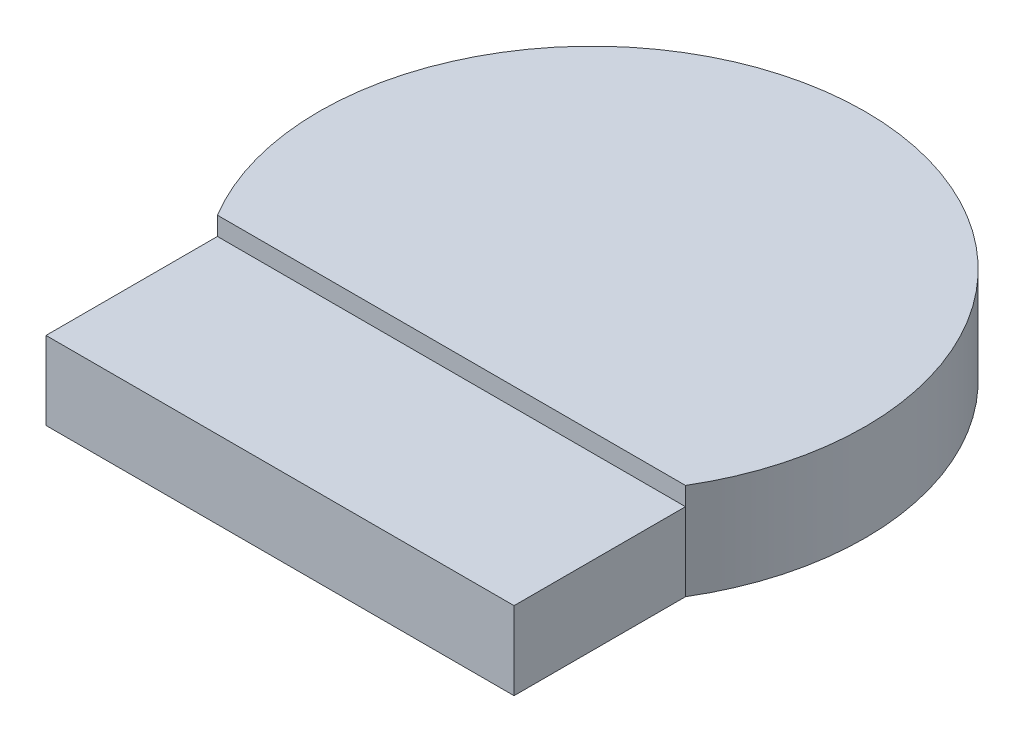
ISO-10303-21;
HEADER;
FILE_DESCRIPTION(('STEP AP214'),'2;1');
FILE_NAME('part.step','',(''),(''),'','','');
FILE_SCHEMA(('AUTOMOTIVE_DESIGN { 1 0 10303 214 1 1 1 1 }'));
ENDSEC;
DATA;
#1=APPLICATION_CONTEXT('core data for automotive mechanical design processes');
#2=APPLICATION_PROTOCOL_DEFINITION('international standard','automotive_design',2000,#1);
#3=PRODUCT_CONTEXT('',#1,'mechanical');
#4=PRODUCT('Part','Part','',(#3));
#5=PRODUCT_RELATED_PRODUCT_CATEGORY('part','',(#4));
#6=PRODUCT_DEFINITION_FORMATION('','',#4);
#7=PRODUCT_DEFINITION_CONTEXT('part definition',#1,'design');
#8=PRODUCT_DEFINITION('design','',#6,#7);
#9=PRODUCT_DEFINITION_SHAPE('','',#8);
#10=(LENGTH_UNIT() NAMED_UNIT(*) SI_UNIT(.MILLI.,.METRE.));
#11=(NAMED_UNIT(*) PLANE_ANGLE_UNIT() SI_UNIT($,.RADIAN.));
#12=(NAMED_UNIT(*) SI_UNIT($,.STERADIAN.) SOLID_ANGLE_UNIT());
#13=UNCERTAINTY_MEASURE_WITH_UNIT(LENGTH_MEASURE(1.E-05),#10,'distance_accuracy_value','');
#14=(GEOMETRIC_REPRESENTATION_CONTEXT(3) GLOBAL_UNCERTAINTY_ASSIGNED_CONTEXT((#13)) GLOBAL_UNIT_ASSIGNED_CONTEXT((#10,
#11,#12)) REPRESENTATION_CONTEXT('',''));
#15=CARTESIAN_POINT('',(0.,0.,0.));
#16=DIRECTION('',(0.,0.,1.));
#17=DIRECTION('',(1.,0.,0.));
#18=AXIS2_PLACEMENT_3D('',#15,#16,#17);
#19=CARTESIAN_POINT('',(-3.81,2.21,2.28952505992));
#20=DIRECTION('',(0.,0.,-1.));
#21=DIRECTION('',(-1.,0.,0.));
#22=AXIS2_PLACEMENT_3D('',#19,#20,#21);
#23=PLANE('',#22);
#24=DIRECTION('',(0.,1.,0.));
#25=VECTOR('',#24,1.);
#26=CARTESIAN_POINT('',(3.81,2.21,2.28952505992));
#27=LINE('',#26,#25);
#28=CARTESIAN_POINT('',(3.80999999999989,2.21,2.28952505992));
#29=VERTEX_POINT('',#28);
#30=CARTESIAN_POINT('',(3.81,1.91,2.28952505992));
#31=VERTEX_POINT('',#30);
#32=EDGE_CURVE('E67',#29,#31,#27,.F.);
#33=ORIENTED_EDGE('',*,*,#32,.F.);
#34=DIRECTION('',(1.,0.,0.));
#35=VECTOR('',#34,1.);
#36=CARTESIAN_POINT('',(0.,2.21,2.28952505992));
#37=LINE('',#36,#35);
#38=CARTESIAN_POINT('',(-3.80999999999989,2.21,2.28952505992));
#39=VERTEX_POINT('',#38);
#40=EDGE_CURVE('E74',#39,#29,#37,.T.);
#41=ORIENTED_EDGE('',*,*,#40,.F.);
#42=DIRECTION('',(0.,1.,0.));
#43=VECTOR('',#42,1.);
#44=CARTESIAN_POINT('',(-3.81,2.21,2.28952505992));
#45=LINE('',#44,#43);
#46=CARTESIAN_POINT('',(-3.81,1.91,2.28952505992));
#47=VERTEX_POINT('',#46);
#48=EDGE_CURVE('E61',#47,#39,#45,.T.);
#49=ORIENTED_EDGE('',*,*,#48,.F.);
#50=DIRECTION('',(1.,0.,0.));
#51=VECTOR('',#50,1.);
#52=CARTESIAN_POINT('',(0.,1.91,2.28952505992));
#53=LINE('',#52,#51);
#54=EDGE_CURVE('E72',#31,#47,#53,.F.);
#55=ORIENTED_EDGE('',*,*,#54,.F.);
#56=EDGE_LOOP('',(#33,#41,#49,#55));
#57=FACE_BOUND('',#56,.T.);
#58=ADVANCED_FACE('F17',(#57),#23,.F.);
#59=CARTESIAN_POINT('',(0.,2.21,0.));
#60=DIRECTION('',(0.,1.,0.));
#61=DIRECTION('',(0.,0.,1.));
#62=AXIS2_PLACEMENT_3D('',#59,#60,#61);
#63=PLANE('',#62);
#64=CARTESIAN_POINT('',(0.,2.21,0.));
#65=DIRECTION('',(0.,-1.,0.));
#66=DIRECTION('',(0.,0.,-1.));
#67=AXIS2_PLACEMENT_3D('',#64,#65,#66);
#68=CIRCLE('',#67,4.445);
#69=EDGE_CURVE('E20',#39,#29,#68,.T.);
#70=ORIENTED_EDGE('',*,*,#69,.F.);
#71=ORIENTED_EDGE('',*,*,#40,.T.);
#72=EDGE_LOOP('',(#70,#71));
#73=FACE_BOUND('',#72,.T.);
#74=ADVANCED_FACE('F78',(#73),#63,.T.);
#75=CARTESIAN_POINT('',(0.,1.91,0.));
#76=DIRECTION('',(0.,1.,0.));
#77=DIRECTION('',(0.,0.,1.));
#78=AXIS2_PLACEMENT_3D('',#75,#76,#77);
#79=PLANE('',#78);
#80=DIRECTION('',(-1.,0.,0.));
#81=VECTOR('',#80,1.);
#82=CARTESIAN_POINT('',(-3.81,1.91,5.08));
#83=LINE('',#82,#81);
#84=CARTESIAN_POINT('',(-3.81,1.91,5.08));
#85=VERTEX_POINT('',#84);
#86=CARTESIAN_POINT('',(3.81,1.91,5.08));
#87=VERTEX_POINT('',#86);
#88=EDGE_CURVE('E105',#85,#87,#83,.F.);
#89=ORIENTED_EDGE('',*,*,#88,.T.);
#90=DIRECTION('',(0.,0.,1.));
#91=VECTOR('',#90,1.);
#92=CARTESIAN_POINT('',(3.81,1.91,2.28952505992));
#93=LINE('',#92,#91);
#94=EDGE_CURVE('E95',#87,#31,#93,.F.);
#95=ORIENTED_EDGE('',*,*,#94,.T.);
#96=ORIENTED_EDGE('',*,*,#54,.T.);
#97=DIRECTION('',(0.,0.,-1.));
#98=VECTOR('',#97,1.);
#99=CARTESIAN_POINT('',(-3.81,1.91,2.28952505992));
#100=LINE('',#99,#98);
#101=EDGE_CURVE('E115',#47,#85,#100,.F.);
#102=ORIENTED_EDGE('',*,*,#101,.T.);
#103=EDGE_LOOP('',(#89,#95,#96,#102));
#104=FACE_BOUND('',#103,.T.);
#105=ADVANCED_FACE('F130',(#104),#79,.T.);
#106=CARTESIAN_POINT('',(0.,1.91,0.));
#107=DIRECTION('',(0.,-1.,0.));
#108=DIRECTION('',(0.,0.,-1.));
#109=AXIS2_PLACEMENT_3D('',#106,#107,#108);
#110=CYLINDRICAL_SURFACE('',#109,4.445);
#111=DIRECTION('',(0.,1.,0.));
#112=VECTOR('',#111,1.);
#113=CARTESIAN_POINT('',(-3.81,1.91,2.28952505992));
#114=LINE('',#113,#112);
#115=CARTESIAN_POINT('',(-3.81,0.64,2.28952505991982));
#116=VERTEX_POINT('',#115);
#117=EDGE_CURVE('E71',#116,#47,#114,.T.);
#118=ORIENTED_EDGE('',*,*,#117,.T.);
#119=ORIENTED_EDGE('',*,*,#48,.T.);
#120=ORIENTED_EDGE('',*,*,#69,.T.);
#121=ORIENTED_EDGE('',*,*,#32,.T.);
#122=DIRECTION('',(0.,1.,0.));
#123=VECTOR('',#122,1.);
#124=CARTESIAN_POINT('',(3.81,1.91,2.28952505992));
#125=LINE('',#124,#123);
#126=CARTESIAN_POINT('',(3.81,0.64,2.28952505991982));
#127=VERTEX_POINT('',#126);
#128=EDGE_CURVE('E91',#31,#127,#125,.F.);
#129=ORIENTED_EDGE('',*,*,#128,.T.);
#130=CARTESIAN_POINT('',(0.,0.64,0.));
#131=DIRECTION('',(0.,-1.,0.));
#132=DIRECTION('',(0.,0.,-1.));
#133=AXIS2_PLACEMENT_3D('',#130,#131,#132);
#134=CIRCLE('',#133,4.445);
#135=EDGE_CURVE('E89',#127,#116,#134,.F.);
#136=ORIENTED_EDGE('',*,*,#135,.T.);
#137=EDGE_LOOP('',(#118,#119,#120,#121,#129,#136));
#138=FACE_BOUND('',#137,.T.);
#139=ADVANCED_FACE('F65',(#138),#110,.T.);
#140=CARTESIAN_POINT('',(-3.81,1.91,2.28952505992));
#141=DIRECTION('',(1.,0.,0.));
#142=DIRECTION('',(0.,0.,-1.));
#143=AXIS2_PLACEMENT_3D('',#140,#141,#142);
#144=PLANE('',#143);
#145=DIRECTION('',(0.,1.,0.));
#146=VECTOR('',#145,1.);
#147=CARTESIAN_POINT('',(-3.81,1.91,5.08));
#148=LINE('',#147,#146);
#149=CARTESIAN_POINT('',(-3.81,0.64,5.08));
#150=VERTEX_POINT('',#149);
#151=EDGE_CURVE('E112',#150,#85,#148,.T.);
#152=ORIENTED_EDGE('',*,*,#151,.T.);
#153=ORIENTED_EDGE('',*,*,#101,.F.);
#154=ORIENTED_EDGE('',*,*,#117,.F.);
#155=DIRECTION('',(0.,0.,1.));
#156=VECTOR('',#155,1.);
#157=CARTESIAN_POINT('',(-3.81,0.64,0.));
#158=LINE('',#157,#156);
#159=EDGE_CURVE('E90',#116,#150,#158,.T.);
#160=ORIENTED_EDGE('',*,*,#159,.T.);
#161=EDGE_LOOP('',(#152,#153,#154,#160));
#162=FACE_BOUND('',#161,.T.);
#163=ADVANCED_FACE('F135',(#162),#144,.F.);
#164=CARTESIAN_POINT('',(-3.81,1.91,5.08));
#165=DIRECTION('',(0.,0.,-1.));
#166=DIRECTION('',(-1.,0.,0.));
#167=AXIS2_PLACEMENT_3D('',#164,#165,#166);
#168=PLANE('',#167);
#169=DIRECTION('',(0.,1.,0.));
#170=VECTOR('',#169,1.);
#171=CARTESIAN_POINT('',(3.81,1.91,5.08));
#172=LINE('',#171,#170);
#173=CARTESIAN_POINT('',(3.81,0.64,5.08));
#174=VERTEX_POINT('',#173);
#175=EDGE_CURVE('E34',#174,#87,#172,.T.);
#176=ORIENTED_EDGE('',*,*,#175,.T.);
#177=ORIENTED_EDGE('',*,*,#88,.F.);
#178=ORIENTED_EDGE('',*,*,#151,.F.);
#179=DIRECTION('',(1.,0.,0.));
#180=VECTOR('',#179,1.);
#181=CARTESIAN_POINT('',(0.,0.64,5.08));
#182=LINE('',#181,#180);
#183=EDGE_CURVE('E26',#150,#174,#182,.T.);
#184=ORIENTED_EDGE('',*,*,#183,.T.);
#185=EDGE_LOOP('',(#176,#177,#178,#184));
#186=FACE_BOUND('',#185,.T.);
#187=ADVANCED_FACE('F133',(#186),#168,.F.);
#188=CARTESIAN_POINT('',(3.81,1.91,2.28952505992));
#189=DIRECTION('',(-1.,0.,0.));
#190=DIRECTION('',(0.,0.,1.));
#191=AXIS2_PLACEMENT_3D('',#188,#189,#190);
#192=PLANE('',#191);
#193=ORIENTED_EDGE('',*,*,#128,.F.);
#194=ORIENTED_EDGE('',*,*,#94,.F.);
#195=ORIENTED_EDGE('',*,*,#175,.F.);
#196=DIRECTION('',(0.,0.,1.));
#197=VECTOR('',#196,1.);
#198=CARTESIAN_POINT('',(3.81,0.64,0.));
#199=LINE('',#198,#197);
#200=EDGE_CURVE('E11',#174,#127,#199,.F.);
#201=ORIENTED_EDGE('',*,*,#200,.T.);
#202=EDGE_LOOP('',(#193,#194,#195,#201));
#203=FACE_BOUND('',#202,.T.);
#204=ADVANCED_FACE('F139',(#203),#192,.F.);
#205=CARTESIAN_POINT('',(0.,0.64,0.));
#206=DIRECTION('',(0.,1.,0.));
#207=DIRECTION('',(0.,0.,1.));
#208=AXIS2_PLACEMENT_3D('',#205,#206,#207);
#209=PLANE('',#208);
#210=ORIENTED_EDGE('',*,*,#183,.F.);
#211=ORIENTED_EDGE('',*,*,#159,.F.);
#212=ORIENTED_EDGE('',*,*,#135,.F.);
#213=ORIENTED_EDGE('',*,*,#200,.F.);
#214=EDGE_LOOP('',(#210,#211,#212,#213));
#215=FACE_BOUND('',#214,.T.);
#216=ADVANCED_FACE('F138',(#215),#209,.F.);
#217=CLOSED_SHELL('',(#58,#74,#105,#139,#163,#187,#204,#216));
#218=MANIFOLD_SOLID_BREP('B1',#217);
#219=ADVANCED_BREP_SHAPE_REPRESENTATION('',(#18,#218),#14);
#220=SHAPE_DEFINITION_REPRESENTATION(#9,#219);
ENDSEC;
END-ISO-10303-21;
